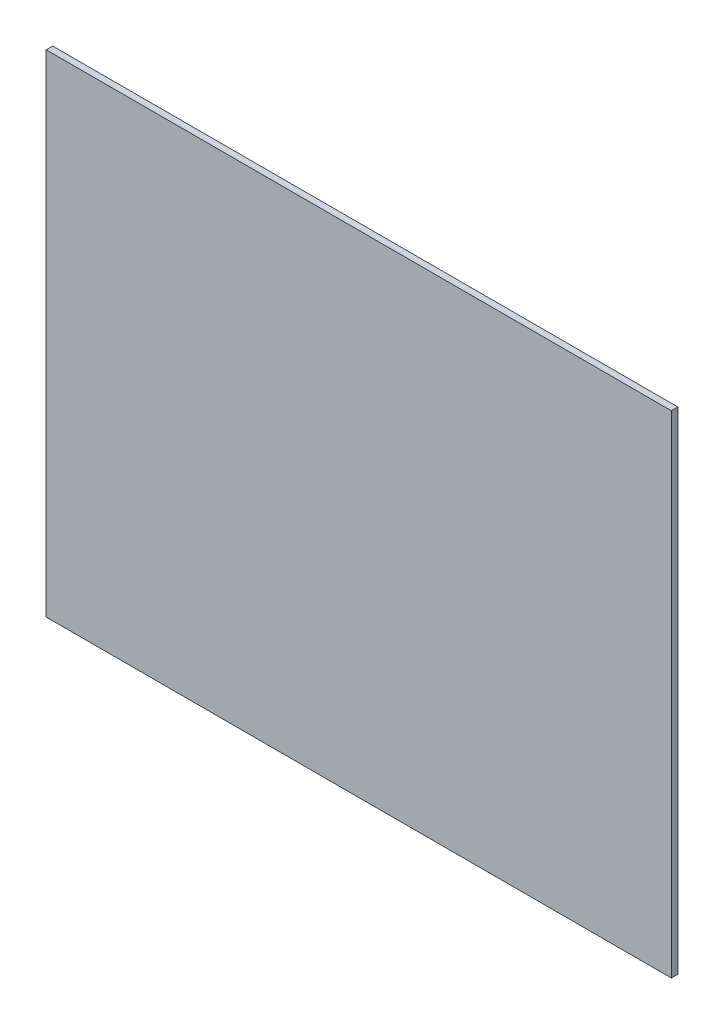
ISO-10303-21;
HEADER;
FILE_DESCRIPTION(('STEP AP214'),'2;1');
FILE_NAME('part.step','',(''),(''),'','','');
FILE_SCHEMA(('AUTOMOTIVE_DESIGN { 1 0 10303 214 1 1 1 1 }'));
ENDSEC;
DATA;
#1=APPLICATION_CONTEXT('core data for automotive mechanical design processes');
#2=APPLICATION_PROTOCOL_DEFINITION('international standard','automotive_design',2000,#1);
#3=PRODUCT_CONTEXT('',#1,'mechanical');
#4=PRODUCT('Part','Part','',(#3));
#5=PRODUCT_RELATED_PRODUCT_CATEGORY('part','',(#4));
#6=PRODUCT_DEFINITION_FORMATION('','',#4);
#7=PRODUCT_DEFINITION_CONTEXT('part definition',#1,'design');
#8=PRODUCT_DEFINITION('design','',#6,#7);
#9=PRODUCT_DEFINITION_SHAPE('','',#8);
#10=(LENGTH_UNIT() NAMED_UNIT(*) SI_UNIT(.MILLI.,.METRE.));
#11=(NAMED_UNIT(*) PLANE_ANGLE_UNIT() SI_UNIT($,.RADIAN.));
#12=(NAMED_UNIT(*) SI_UNIT($,.STERADIAN.) SOLID_ANGLE_UNIT());
#13=UNCERTAINTY_MEASURE_WITH_UNIT(LENGTH_MEASURE(1.E-05),#10,'distance_accuracy_value','');
#14=(GEOMETRIC_REPRESENTATION_CONTEXT(3) GLOBAL_UNCERTAINTY_ASSIGNED_CONTEXT((#13)) GLOBAL_UNIT_ASSIGNED_CONTEXT((#10,
#11,#12)) REPRESENTATION_CONTEXT('',''));
#15=CARTESIAN_POINT('',(0.,0.,0.));
#16=DIRECTION('',(0.,0.,1.));
#17=DIRECTION('',(1.,0.,0.));
#18=AXIS2_PLACEMENT_3D('',#15,#16,#17);
#19=CARTESIAN_POINT('',(-152.0875,-119.5,3.175));
#20=DIRECTION('',(1.,0.,0.));
#21=DIRECTION('',(0.,0.,-1.));
#22=AXIS2_PLACEMENT_3D('',#19,#20,#21);
#23=PLANE('',#22);
#24=DIRECTION('',(0.,-1.,0.));
#25=VECTOR('',#24,1.);
#26=CARTESIAN_POINT('',(-152.0875,-119.5,0.));
#27=LINE('',#26,#25);
#28=CARTESIAN_POINT('',(-152.0875,119.5,0.));
#29=VERTEX_POINT('',#28);
#30=CARTESIAN_POINT('',(-152.0875,-119.5,0.));
#31=VERTEX_POINT('',#30);
#32=EDGE_CURVE('E111',#29,#31,#27,.T.);
#33=ORIENTED_EDGE('',*,*,#32,.T.);
#34=DIRECTION('',(0.,0.,-1.));
#35=VECTOR('',#34,1.);
#36=CARTESIAN_POINT('',(-152.0875,-119.5,3.175));
#37=LINE('',#36,#35);
#38=CARTESIAN_POINT('',(-152.0875,-119.5,3.175));
#39=VERTEX_POINT('',#38);
#40=EDGE_CURVE('E11',#39,#31,#37,.T.);
#41=ORIENTED_EDGE('',*,*,#40,.F.);
#42=DIRECTION('',(0.,-1.,0.));
#43=VECTOR('',#42,1.);
#44=CARTESIAN_POINT('',(-152.0875,-119.5,3.175));
#45=LINE('',#44,#43);
#46=CARTESIAN_POINT('',(-152.0875,119.5,3.175));
#47=VERTEX_POINT('',#46);
#48=EDGE_CURVE('E95',#47,#39,#45,.T.);
#49=ORIENTED_EDGE('',*,*,#48,.F.);
#50=DIRECTION('',(0.,0.,-1.));
#51=VECTOR('',#50,1.);
#52=CARTESIAN_POINT('',(-152.0875,119.5,3.175));
#53=LINE('',#52,#51);
#54=EDGE_CURVE('E107',#47,#29,#53,.T.);
#55=ORIENTED_EDGE('',*,*,#54,.T.);
#56=EDGE_LOOP('',(#33,#41,#49,#55));
#57=FACE_BOUND('',#56,.T.);
#58=ADVANCED_FACE('F43',(#57),#23,.F.);
#59=CARTESIAN_POINT('',(152.0875,-119.5,3.175));
#60=DIRECTION('',(0.,1.,0.));
#61=DIRECTION('',(-1.,0.,0.));
#62=AXIS2_PLACEMENT_3D('',#59,#60,#61);
#63=PLANE('',#62);
#64=DIRECTION('',(1.,0.,0.));
#65=VECTOR('',#64,1.);
#66=CARTESIAN_POINT('',(152.0875,-119.5,0.));
#67=LINE('',#66,#65);
#68=CARTESIAN_POINT('',(152.0875,-119.5,0.));
#69=VERTEX_POINT('',#68);
#70=EDGE_CURVE('E100',#31,#69,#67,.T.);
#71=ORIENTED_EDGE('',*,*,#70,.T.);
#72=DIRECTION('',(0.,0.,-1.));
#73=VECTOR('',#72,1.);
#74=CARTESIAN_POINT('',(152.0875,-119.5,3.175));
#75=LINE('',#74,#73);
#76=CARTESIAN_POINT('',(152.0875,-119.5,3.175));
#77=VERTEX_POINT('',#76);
#78=EDGE_CURVE('E52',#77,#69,#75,.T.);
#79=ORIENTED_EDGE('',*,*,#78,.F.);
#80=DIRECTION('',(1.,0.,0.));
#81=VECTOR('',#80,1.);
#82=CARTESIAN_POINT('',(152.0875,-119.5,3.175));
#83=LINE('',#82,#81);
#84=EDGE_CURVE('E90',#39,#77,#83,.T.);
#85=ORIENTED_EDGE('',*,*,#84,.F.);
#86=ORIENTED_EDGE('',*,*,#40,.T.);
#87=EDGE_LOOP('',(#71,#79,#85,#86));
#88=FACE_BOUND('',#87,.T.);
#89=ADVANCED_FACE('F99',(#88),#63,.F.);
#90=CARTESIAN_POINT('',(152.0875,-119.5,3.175));
#91=DIRECTION('',(-1.,0.,0.));
#92=DIRECTION('',(0.,0.,1.));
#93=AXIS2_PLACEMENT_3D('',#90,#91,#92);
#94=PLANE('',#93);
#95=DIRECTION('',(0.,1.,0.));
#96=VECTOR('',#95,1.);
#97=CARTESIAN_POINT('',(152.0875,-119.5,0.));
#98=LINE('',#97,#96);
#99=CARTESIAN_POINT('',(152.0875,119.5,0.));
#100=VERTEX_POINT('',#99);
#101=EDGE_CURVE('E77',#69,#100,#98,.T.);
#102=ORIENTED_EDGE('',*,*,#101,.T.);
#103=DIRECTION('',(0.,0.,-1.));
#104=VECTOR('',#103,1.);
#105=CARTESIAN_POINT('',(152.0875,119.5,3.175));
#106=LINE('',#105,#104);
#107=CARTESIAN_POINT('',(152.0875,119.5,3.175));
#108=VERTEX_POINT('',#107);
#109=EDGE_CURVE('E102',#108,#100,#106,.T.);
#110=ORIENTED_EDGE('',*,*,#109,.F.);
#111=DIRECTION('',(0.,1.,0.));
#112=VECTOR('',#111,1.);
#113=CARTESIAN_POINT('',(152.0875,-119.5,3.175));
#114=LINE('',#113,#112);
#115=EDGE_CURVE('E93',#77,#108,#114,.T.);
#116=ORIENTED_EDGE('',*,*,#115,.F.);
#117=ORIENTED_EDGE('',*,*,#78,.T.);
#118=EDGE_LOOP('',(#102,#110,#116,#117));
#119=FACE_BOUND('',#118,.T.);
#120=ADVANCED_FACE('F103',(#119),#94,.F.);
#121=CARTESIAN_POINT('',(152.0875,119.5,3.175));
#122=DIRECTION('',(0.,-1.,0.));
#123=DIRECTION('',(0.,0.,-1.));
#124=AXIS2_PLACEMENT_3D('',#121,#122,#123);
#125=PLANE('',#124);
#126=DIRECTION('',(-1.,0.,0.));
#127=VECTOR('',#126,1.);
#128=CARTESIAN_POINT('',(152.0875,119.5,0.));
#129=LINE('',#128,#127);
#130=EDGE_CURVE('E83',#100,#29,#129,.T.);
#131=ORIENTED_EDGE('',*,*,#130,.T.);
#132=ORIENTED_EDGE('',*,*,#54,.F.);
#133=DIRECTION('',(-1.,0.,0.));
#134=VECTOR('',#133,1.);
#135=CARTESIAN_POINT('',(152.0875,119.5,3.175));
#136=LINE('',#135,#134);
#137=EDGE_CURVE('E60',#108,#47,#136,.T.);
#138=ORIENTED_EDGE('',*,*,#137,.F.);
#139=ORIENTED_EDGE('',*,*,#109,.T.);
#140=EDGE_LOOP('',(#131,#132,#138,#139));
#141=FACE_BOUND('',#140,.T.);
#142=ADVANCED_FACE('F124',(#141),#125,.F.);
#143=CARTESIAN_POINT('',(0.,0.,3.175));
#144=DIRECTION('',(0.,0.,1.));
#145=DIRECTION('',(1.,0.,0.));
#146=AXIS2_PLACEMENT_3D('',#143,#144,#145);
#147=PLANE('',#146);
#148=ORIENTED_EDGE('',*,*,#48,.T.);
#149=ORIENTED_EDGE('',*,*,#84,.T.);
#150=ORIENTED_EDGE('',*,*,#115,.T.);
#151=ORIENTED_EDGE('',*,*,#137,.T.);
#152=EDGE_LOOP('',(#148,#149,#150,#151));
#153=FACE_BOUND('',#152,.T.);
#154=ADVANCED_FACE('F91',(#153),#147,.T.);
#155=CARTESIAN_POINT('',(0.,0.,0.));
#156=DIRECTION('',(0.,0.,1.));
#157=DIRECTION('',(1.,0.,0.));
#158=AXIS2_PLACEMENT_3D('',#155,#156,#157);
#159=PLANE('',#158);
#160=ORIENTED_EDGE('',*,*,#32,.F.);
#161=ORIENTED_EDGE('',*,*,#130,.F.);
#162=ORIENTED_EDGE('',*,*,#101,.F.);
#163=ORIENTED_EDGE('',*,*,#70,.F.);
#164=EDGE_LOOP('',(#160,#161,#162,#163));
#165=FACE_BOUND('',#164,.T.);
#166=ADVANCED_FACE('F127',(#165),#159,.F.);
#167=CLOSED_SHELL('',(#58,#89,#120,#142,#154,#166));
#168=MANIFOLD_SOLID_BREP('B2',#167);
#169=ADVANCED_BREP_SHAPE_REPRESENTATION('',(#18,#168),#14);
#170=SHAPE_DEFINITION_REPRESENTATION(#9,#169);
ENDSEC;
END-ISO-10303-21;
